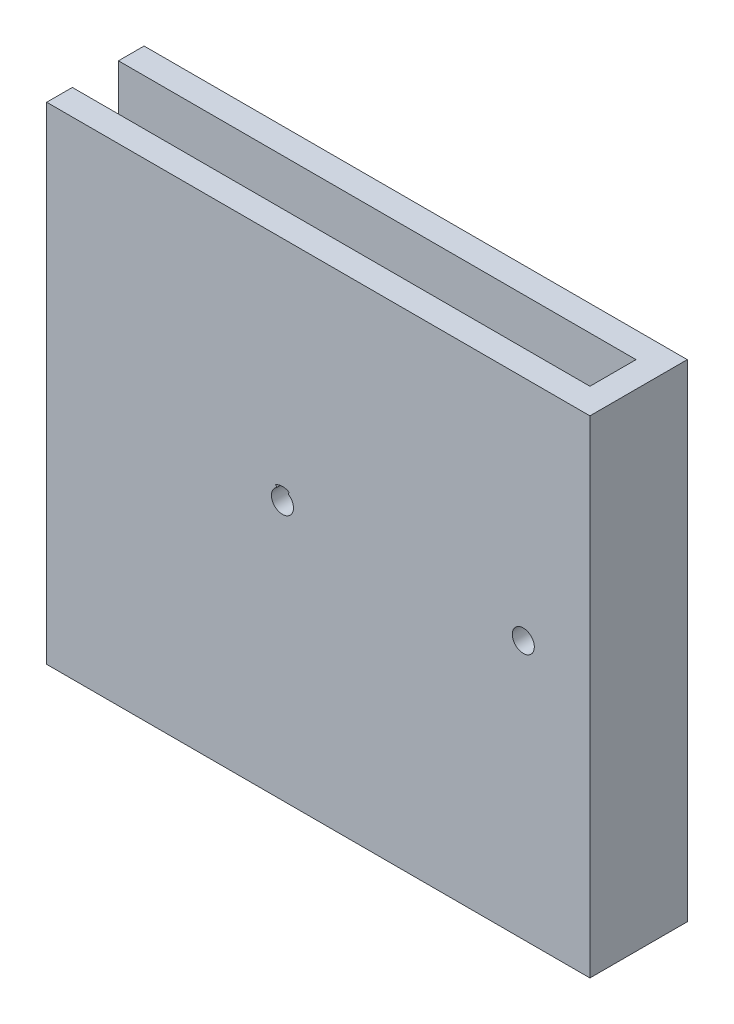
ISO-10303-21;
HEADER;
FILE_DESCRIPTION(('STEP AP214'),'2;1');
FILE_NAME('part.step','',(''),(''),'','','');
FILE_SCHEMA(('AUTOMOTIVE_DESIGN { 1 0 10303 214 1 1 1 1 }'));
ENDSEC;
DATA;
#1=APPLICATION_CONTEXT('core data for automotive mechanical design processes');
#2=APPLICATION_PROTOCOL_DEFINITION('international standard','automotive_design',2000,#1);
#3=PRODUCT_CONTEXT('',#1,'mechanical');
#4=PRODUCT('Part','Part','',(#3));
#5=PRODUCT_RELATED_PRODUCT_CATEGORY('part','',(#4));
#6=PRODUCT_DEFINITION_FORMATION('','',#4);
#7=PRODUCT_DEFINITION_CONTEXT('part definition',#1,'design');
#8=PRODUCT_DEFINITION('design','',#6,#7);
#9=PRODUCT_DEFINITION_SHAPE('','',#8);
#10=(LENGTH_UNIT() NAMED_UNIT(*) SI_UNIT(.MILLI.,.METRE.));
#11=(NAMED_UNIT(*) PLANE_ANGLE_UNIT() SI_UNIT($,.RADIAN.));
#12=(NAMED_UNIT(*) SI_UNIT($,.STERADIAN.) SOLID_ANGLE_UNIT());
#13=UNCERTAINTY_MEASURE_WITH_UNIT(LENGTH_MEASURE(1.E-05),#10,'distance_accuracy_value','');
#14=(GEOMETRIC_REPRESENTATION_CONTEXT(3) GLOBAL_UNCERTAINTY_ASSIGNED_CONTEXT((#13)) GLOBAL_UNIT_ASSIGNED_CONTEXT((#10,
#11,#12)) REPRESENTATION_CONTEXT('',''));
#15=CARTESIAN_POINT('',(0.,0.,0.));
#16=DIRECTION('',(0.,0.,1.));
#17=DIRECTION('',(1.,0.,0.));
#18=AXIS2_PLACEMENT_3D('',#15,#16,#17);
#19=CARTESIAN_POINT('',(-20.1463414634146,55.4268292682927,5.));
#20=DIRECTION('',(1.,0.,0.));
#21=DIRECTION('',(0.,0.,-1.));
#22=AXIS2_PLACEMENT_3D('',#19,#20,#21);
#23=PLANE('',#22);
#24=DIRECTION('',(0.,-1.,0.));
#25=VECTOR('',#24,1.);
#26=CARTESIAN_POINT('',(-20.1463414634146,55.4268292682927,0.));
#27=LINE('',#26,#25);
#28=CARTESIAN_POINT('',(-20.1463414634146,55.4268292682927,0.));
#29=VERTEX_POINT('',#28);
#30=CARTESIAN_POINT('',(-20.1463414634146,-34.5731707317073,0.));
#31=VERTEX_POINT('',#30);
#32=EDGE_CURVE('E301',#29,#31,#27,.T.);
#33=ORIENTED_EDGE('',*,*,#32,.T.);
#34=DIRECTION('',(0.,0.,-1.));
#35=VECTOR('',#34,1.);
#36=CARTESIAN_POINT('',(-20.1463414634146,-34.5731707317073,5.));
#37=LINE('',#36,#35);
#38=CARTESIAN_POINT('',(-20.1463414634146,-34.5731707317073,-9.00000000000001));
#39=VERTEX_POINT('',#38);
#40=EDGE_CURVE('E247',#31,#39,#37,.T.);
#41=ORIENTED_EDGE('',*,*,#40,.T.);
#42=DIRECTION('',(0.,1.,0.));
#43=VECTOR('',#42,1.);
#44=CARTESIAN_POINT('',(-20.1463414634146,55.4268292682927,-9.00000000000001));
#45=LINE('',#44,#43);
#46=CARTESIAN_POINT('',(-20.1463414634146,55.4268292682927,-9.00000000000001));
#47=VERTEX_POINT('',#46);
#48=EDGE_CURVE('E283',#39,#47,#45,.T.);
#49=ORIENTED_EDGE('',*,*,#48,.T.);
#50=DIRECTION('',(0.,0.,1.));
#51=VECTOR('',#50,1.);
#52=CARTESIAN_POINT('',(-20.1463414634146,55.4268292682927,-14.));
#53=LINE('',#52,#51);
#54=CARTESIAN_POINT('',(-20.1463414634146,55.4268292682927,-14.));
#55=VERTEX_POINT('',#54);
#56=EDGE_CURVE('E279',#55,#47,#53,.T.);
#57=ORIENTED_EDGE('',*,*,#56,.F.);
#58=DIRECTION('',(0.,1.,0.));
#59=VECTOR('',#58,1.);
#60=CARTESIAN_POINT('',(-20.1463414634146,55.4268292682927,-14.));
#61=LINE('',#60,#59);
#62=CARTESIAN_POINT('',(-20.1463414634146,-39.5731707317073,-14.));
#63=VERTEX_POINT('',#62);
#64=EDGE_CURVE('E271',#63,#55,#61,.T.);
#65=ORIENTED_EDGE('',*,*,#64,.F.);
#66=DIRECTION('',(0.,0.,-1.));
#67=VECTOR('',#66,1.);
#68=CARTESIAN_POINT('',(-20.1463414634146,-39.5731707317073,5.));
#69=LINE('',#68,#67);
#70=CARTESIAN_POINT('',(-20.1463414634146,-39.5731707317073,5.));
#71=VERTEX_POINT('',#70);
#72=EDGE_CURVE('E248',#71,#63,#69,.T.);
#73=ORIENTED_EDGE('',*,*,#72,.F.);
#74=DIRECTION('',(0.,-1.,0.));
#75=VECTOR('',#74,1.);
#76=CARTESIAN_POINT('',(-20.1463414634146,55.4268292682927,5.));
#77=LINE('',#76,#75);
#78=CARTESIAN_POINT('',(-20.1463414634146,55.4268292682927,5.));
#79=VERTEX_POINT('',#78);
#80=EDGE_CURVE('E312',#79,#71,#77,.T.);
#81=ORIENTED_EDGE('',*,*,#80,.F.);
#82=DIRECTION('',(0.,0.,-1.));
#83=VECTOR('',#82,1.);
#84=CARTESIAN_POINT('',(-20.1463414634146,55.4268292682927,5.));
#85=LINE('',#84,#83);
#86=EDGE_CURVE('E319',#79,#29,#85,.T.);
#87=ORIENTED_EDGE('',*,*,#86,.T.);
#88=EDGE_LOOP('',(#33,#41,#49,#57,#65,#73,#81,#87));
#89=FACE_BOUND('',#88,.T.);
#90=ADVANCED_FACE('F41',(#89),#23,.F.);
#91=CARTESIAN_POINT('',(-20.1463414634146,55.4268292682927,5.));
#92=DIRECTION('',(0.,1.,0.));
#93=DIRECTION('',(-1.,0.,0.));
#94=AXIS2_PLACEMENT_3D('',#91,#92,#93);
#95=PLANE('',#94);
#96=DIRECTION('',(1.,0.,0.));
#97=VECTOR('',#96,1.);
#98=CARTESIAN_POINT('',(-20.1463414634146,55.4268292682927,0.));
#99=LINE('',#98,#97);
#100=CARTESIAN_POINT('',(80.8536585365854,55.4268292682927,0.));
#101=VERTEX_POINT('',#100);
#102=EDGE_CURVE('E316',#29,#101,#99,.T.);
#103=ORIENTED_EDGE('',*,*,#102,.F.);
#104=ORIENTED_EDGE('',*,*,#86,.F.);
#105=DIRECTION('',(1.,0.,0.));
#106=VECTOR('',#105,1.);
#107=CARTESIAN_POINT('',(-20.1463414634146,55.4268292682927,5.));
#108=LINE('',#107,#106);
#109=CARTESIAN_POINT('',(85.8536585365854,55.4268292682927,5.));
#110=VERTEX_POINT('',#109);
#111=EDGE_CURVE('E315',#79,#110,#108,.T.);
#112=ORIENTED_EDGE('',*,*,#111,.T.);
#113=DIRECTION('',(0.,0.,1.));
#114=VECTOR('',#113,1.);
#115=CARTESIAN_POINT('',(85.8536585365854,55.4268292682927,5.));
#116=LINE('',#115,#114);
#117=CARTESIAN_POINT('',(85.8536585365854,55.4268292682927,-14.));
#118=VERTEX_POINT('',#117);
#119=EDGE_CURVE('E296',#118,#110,#116,.T.);
#120=ORIENTED_EDGE('',*,*,#119,.F.);
#121=DIRECTION('',(1.,0.,0.));
#122=VECTOR('',#121,1.);
#123=CARTESIAN_POINT('',(85.8536585365854,55.4268292682927,-14.));
#124=LINE('',#123,#122);
#125=EDGE_CURVE('E275',#55,#118,#124,.T.);
#126=ORIENTED_EDGE('',*,*,#125,.F.);
#127=ORIENTED_EDGE('',*,*,#56,.T.);
#128=DIRECTION('',(1.,0.,0.));
#129=VECTOR('',#128,1.);
#130=CARTESIAN_POINT('',(85.8536585365854,55.4268292682927,-9.00000000000001));
#131=LINE('',#130,#129);
#132=CARTESIAN_POINT('',(80.8536585365854,55.4268292682927,-9.00000000000001));
#133=VERTEX_POINT('',#132);
#134=EDGE_CURVE('E272',#47,#133,#131,.T.);
#135=ORIENTED_EDGE('',*,*,#134,.T.);
#136=DIRECTION('',(0.,0.,1.));
#137=VECTOR('',#136,1.);
#138=CARTESIAN_POINT('',(80.8536585365854,55.4268292682927,5.));
#139=LINE('',#138,#137);
#140=EDGE_CURVE('E297',#133,#101,#139,.T.);
#141=ORIENTED_EDGE('',*,*,#140,.T.);
#142=EDGE_LOOP('',(#103,#104,#112,#120,#126,#127,#135,#141));
#143=FACE_BOUND('',#142,.T.);
#144=ADVANCED_FACE('F363',(#143),#95,.T.);
#145=CARTESIAN_POINT('',(0.,0.,5.));
#146=DIRECTION('',(0.,0.,1.));
#147=DIRECTION('',(1.,0.,0.));
#148=AXIS2_PLACEMENT_3D('',#145,#146,#147);
#149=PLANE('',#148);
#150=DIRECTION('',(0.515038074910054,-0.857167300702112,0.));
#151=VECTOR('',#150,1.);
#152=CARTESIAN_POINT('',(25.8536585365854,10.9268292682927,5.));
#153=LINE('',#152,#151);
#154=CARTESIAN_POINT('',(24.5248603033175,13.1383209041041,5.));
#155=VERTEX_POINT('',#154);
#156=CARTESIAN_POINT('',(24.7463266755288,12.7697389648022,5.));
#157=VERTEX_POINT('',#156);
#158=EDGE_CURVE('E173',#155,#157,#153,.T.);
#159=ORIENTED_EDGE('',*,*,#158,.F.);
#160=CARTESIAN_POINT('',(25.8536585365854,10.9268292682927,5.));
#161=DIRECTION('',(0.,0.,1.));
#162=DIRECTION('',(1.,0.,0.));
#163=AXIS2_PLACEMENT_3D('',#160,#161,#162);
#164=CIRCLE('',#163,2.58);
#165=CARTESIAN_POINT('',(27.1824567698533,13.1383209041041,5.));
#166=VERTEX_POINT('',#165);
#167=EDGE_CURVE('E160',#166,#155,#164,.T.);
#168=ORIENTED_EDGE('',*,*,#167,.F.);
#169=DIRECTION('',(0.515038074910054,0.857167300702112,0.));
#170=VECTOR('',#169,1.);
#171=CARTESIAN_POINT('',(25.8536585365854,10.9268292682927,5.));
#172=LINE('',#171,#170);
#173=CARTESIAN_POINT('',(26.960990397642,12.7697389648022,5.));
#174=VERTEX_POINT('',#173);
#175=EDGE_CURVE('E166',#174,#166,#172,.T.);
#176=ORIENTED_EDGE('',*,*,#175,.F.);
#177=CARTESIAN_POINT('',(25.8536585365854,10.9268292682927,5.));
#178=DIRECTION('',(0.,0.,-1.));
#179=DIRECTION('',(0.,1.,0.));
#180=AXIS2_PLACEMENT_3D('',#177,#178,#179);
#181=CIRCLE('',#180,2.15);
#182=EDGE_CURVE('E226',#174,#157,#181,.T.);
#183=ORIENTED_EDGE('',*,*,#182,.T.);
#184=EDGE_LOOP('',(#159,#168,#176,#183));
#185=FACE_BOUND('',#184,.T.);
#186=CARTESIAN_POINT('',(72.8536585365854,10.9268292682927,5.));
#187=DIRECTION('',(0.,0.,-1.));
#188=DIRECTION('',(0.,1.,0.));
#189=AXIS2_PLACEMENT_3D('',#186,#187,#188);
#190=CIRCLE('',#189,2.15);
#191=CARTESIAN_POINT('',(72.8536585365854,13.0768292682927,5.));
#192=VERTEX_POINT('',#191);
#193=EDGE_CURVE('E217',#192,#192,#190,.T.);
#194=ORIENTED_EDGE('',*,*,#193,.T.);
#195=EDGE_LOOP('',(#194));
#196=FACE_BOUND('',#195,.T.);
#197=ORIENTED_EDGE('',*,*,#80,.T.);
#198=DIRECTION('',(-1.,0.,0.));
#199=VECTOR('',#198,1.);
#200=CARTESIAN_POINT('',(-20.1463414634146,-39.5731707317073,5.));
#201=LINE('',#200,#199);
#202=CARTESIAN_POINT('',(85.8536585365854,-39.5731707317073,5.));
#203=VERTEX_POINT('',#202);
#204=EDGE_CURVE('E260',#203,#71,#201,.T.);
#205=ORIENTED_EDGE('',*,*,#204,.F.);
#206=DIRECTION('',(0.,-1.,0.));
#207=VECTOR('',#206,1.);
#208=CARTESIAN_POINT('',(85.8536585365854,55.4268292682927,5.));
#209=LINE('',#208,#207);
#210=EDGE_CURVE('E293',#110,#203,#209,.T.);
#211=ORIENTED_EDGE('',*,*,#210,.F.);
#212=ORIENTED_EDGE('',*,*,#111,.F.);
#213=EDGE_LOOP('',(#197,#205,#211,#212));
#214=FACE_BOUND('',#213,.T.);
#215=ADVANCED_FACE('F175',(#185,#196,#214),#149,.T.);
#216=CARTESIAN_POINT('',(0.,0.,0.));
#217=DIRECTION('',(0.,0.,1.));
#218=DIRECTION('',(1.,0.,0.));
#219=AXIS2_PLACEMENT_3D('',#216,#217,#218);
#220=PLANE('',#219);
#221=CARTESIAN_POINT('',(72.8536585365854,10.9268292682927,0.));
#222=DIRECTION('',(0.,0.,1.));
#223=DIRECTION('',(1.,0.,0.));
#224=AXIS2_PLACEMENT_3D('',#221,#222,#223);
#225=CIRCLE('',#224,2.15);
#226=CARTESIAN_POINT('',(75.0036585365854,10.9268292682927,0.));
#227=VERTEX_POINT('',#226);
#228=EDGE_CURVE('E243',#227,#227,#225,.T.);
#229=ORIENTED_EDGE('',*,*,#228,.T.);
#230=EDGE_LOOP('',(#229));
#231=FACE_BOUND('',#230,.T.);
#232=CARTESIAN_POINT('',(25.8536585365854,10.9268292682927,0.));
#233=DIRECTION('',(0.,0.,1.));
#234=DIRECTION('',(1.,0.,0.));
#235=AXIS2_PLACEMENT_3D('',#232,#233,#234);
#236=CIRCLE('',#235,2.58);
#237=CARTESIAN_POINT('',(27.1824567698533,13.1383209041041,0.));
#238=VERTEX_POINT('',#237);
#239=CARTESIAN_POINT('',(24.5248603033175,13.1383209041041,0.));
#240=VERTEX_POINT('',#239);
#241=EDGE_CURVE('E11',#238,#240,#236,.T.);
#242=ORIENTED_EDGE('',*,*,#241,.T.);
#243=DIRECTION('',(0.515038074910054,-0.857167300702112,0.));
#244=VECTOR('',#243,1.);
#245=CARTESIAN_POINT('',(23.8195168067542,14.3122096134437,0.));
#246=LINE('',#245,#244);
#247=CARTESIAN_POINT('',(24.7463266755288,12.7697389648022,0.));
#248=VERTEX_POINT('',#247);
#249=EDGE_CURVE('E185',#240,#248,#246,.T.);
#250=ORIENTED_EDGE('',*,*,#249,.T.);
#251=CARTESIAN_POINT('',(25.8536585365854,10.9268292682927,0.));
#252=DIRECTION('',(0.,0.,1.));
#253=DIRECTION('',(1.,0.,0.));
#254=AXIS2_PLACEMENT_3D('',#251,#252,#253);
#255=CIRCLE('',#254,2.15);
#256=CARTESIAN_POINT('',(26.960990397642,12.7697389648022,0.));
#257=VERTEX_POINT('',#256);
#258=EDGE_CURVE('E235',#248,#257,#255,.T.);
#259=ORIENTED_EDGE('',*,*,#258,.T.);
#260=DIRECTION('',(0.515038074910054,0.857167300702112,0.));
#261=VECTOR('',#260,1.);
#262=CARTESIAN_POINT('',(14.1716992067347,-8.51521595803101,0.));
#263=LINE('',#262,#261);
#264=EDGE_CURVE('E56',#257,#238,#263,.T.);
#265=ORIENTED_EDGE('',*,*,#264,.T.);
#266=EDGE_LOOP('',(#242,#250,#259,#265));
#267=FACE_BOUND('',#266,.T.);
#268=ORIENTED_EDGE('',*,*,#32,.F.);
#269=ORIENTED_EDGE('',*,*,#102,.T.);
#270=DIRECTION('',(0.,-1.,0.));
#271=VECTOR('',#270,1.);
#272=CARTESIAN_POINT('',(80.8536585365854,55.4268292682927,0.));
#273=LINE('',#272,#271);
#274=CARTESIAN_POINT('',(80.8536585365854,-34.5731707317073,0.));
#275=VERTEX_POINT('',#274);
#276=EDGE_CURVE('E327',#101,#275,#273,.T.);
#277=ORIENTED_EDGE('',*,*,#276,.T.);
#278=DIRECTION('',(1.,0.,0.));
#279=VECTOR('',#278,1.);
#280=CARTESIAN_POINT('',(-20.1463414634146,-34.5731707317073,0.));
#281=LINE('',#280,#279);
#282=EDGE_CURVE('E323',#31,#275,#281,.T.);
#283=ORIENTED_EDGE('',*,*,#282,.F.);
#284=EDGE_LOOP('',(#268,#269,#277,#283));
#285=FACE_BOUND('',#284,.T.);
#286=ADVANCED_FACE('F352',(#231,#267,#285),#220,.F.);
#287=CARTESIAN_POINT('',(85.8536585365854,0.,0.));
#288=DIRECTION('',(1.,0.,0.));
#289=DIRECTION('',(0.,0.,-1.));
#290=AXIS2_PLACEMENT_3D('',#287,#288,#289);
#291=PLANE('',#290);
#292=ORIENTED_EDGE('',*,*,#210,.T.);
#293=DIRECTION('',(0.,0.,1.));
#294=VECTOR('',#293,1.);
#295=CARTESIAN_POINT('',(85.8536585365854,-39.5731707317073,5.));
#296=LINE('',#295,#294);
#297=CARTESIAN_POINT('',(85.8536585365854,-39.5731707317073,-14.));
#298=VERTEX_POINT('',#297);
#299=EDGE_CURVE('E256',#298,#203,#296,.T.);
#300=ORIENTED_EDGE('',*,*,#299,.F.);
#301=DIRECTION('',(0.,-1.,0.));
#302=VECTOR('',#301,1.);
#303=CARTESIAN_POINT('',(85.8536585365854,55.4268292682927,-14.));
#304=LINE('',#303,#302);
#305=EDGE_CURVE('E268',#118,#298,#304,.T.);
#306=ORIENTED_EDGE('',*,*,#305,.F.);
#307=ORIENTED_EDGE('',*,*,#119,.T.);
#308=EDGE_LOOP('',(#292,#300,#306,#307));
#309=FACE_BOUND('',#308,.T.);
#310=ADVANCED_FACE('F355',(#309),#291,.T.);
#311=CARTESIAN_POINT('',(80.8536585365854,0.,0.));
#312=DIRECTION('',(1.,0.,0.));
#313=DIRECTION('',(0.,0.,-1.));
#314=AXIS2_PLACEMENT_3D('',#311,#312,#313);
#315=PLANE('',#314);
#316=ORIENTED_EDGE('',*,*,#276,.F.);
#317=ORIENTED_EDGE('',*,*,#140,.F.);
#318=DIRECTION('',(0.,1.,0.));
#319=VECTOR('',#318,1.);
#320=CARTESIAN_POINT('',(80.8536585365854,55.4268292682927,-9.00000000000001));
#321=LINE('',#320,#319);
#322=CARTESIAN_POINT('',(80.8536585365854,-34.5731707317073,-9.00000000000001));
#323=VERTEX_POINT('',#322);
#324=EDGE_CURVE('E305',#323,#133,#321,.T.);
#325=ORIENTED_EDGE('',*,*,#324,.F.);
#326=DIRECTION('',(0.,0.,-1.));
#327=VECTOR('',#326,1.);
#328=CARTESIAN_POINT('',(80.8536585365854,-34.5731707317073,5.));
#329=LINE('',#328,#327);
#330=EDGE_CURVE('E292',#275,#323,#329,.T.);
#331=ORIENTED_EDGE('',*,*,#330,.F.);
#332=EDGE_LOOP('',(#316,#317,#325,#331));
#333=FACE_BOUND('',#332,.T.);
#334=ADVANCED_FACE('F367',(#333),#315,.F.);
#335=CARTESIAN_POINT('',(0.,0.,-9.00000000000001));
#336=DIRECTION('',(0.,0.,-1.));
#337=DIRECTION('',(0.,1.,0.));
#338=AXIS2_PLACEMENT_3D('',#335,#336,#337);
#339=PLANE('',#338);
#340=CARTESIAN_POINT('',(72.8536585365854,10.9268292682927,-9.00000000000001));
#341=DIRECTION('',(0.,0.,-1.));
#342=DIRECTION('',(0.,1.,0.));
#343=AXIS2_PLACEMENT_3D('',#340,#341,#342);
#344=CIRCLE('',#343,2.58);
#345=CARTESIAN_POINT('',(71.5248603033175,13.1383209041041,-9.00000000000001));
#346=VERTEX_POINT('',#345);
#347=CARTESIAN_POINT('',(74.1824567698533,13.1383209041041,-9.00000000000001));
#348=VERTEX_POINT('',#347);
#349=EDGE_CURVE('E212',#346,#348,#344,.T.);
#350=ORIENTED_EDGE('',*,*,#349,.T.);
#351=DIRECTION('',(-0.515038074910049,-0.857167300702116,0.));
#352=VECTOR('',#351,1.);
#353=CARTESIAN_POINT('',(48.7042809322036,-29.2644843902156,-9.00000000000001));
#354=LINE('',#353,#352);
#355=CARTESIAN_POINT('',(73.960990397642,12.7697389648022,-9.00000000000001));
#356=VERTEX_POINT('',#355);
#357=EDGE_CURVE('E208',#348,#356,#354,.T.);
#358=ORIENTED_EDGE('',*,*,#357,.T.);
#359=CARTESIAN_POINT('',(72.8536585365854,10.9268292682927,-9.00000000000001));
#360=DIRECTION('',(0.,0.,-1.));
#361=DIRECTION('',(0.,1.,0.));
#362=AXIS2_PLACEMENT_3D('',#359,#360,#361);
#363=CIRCLE('',#362,2.15);
#364=CARTESIAN_POINT('',(71.7463266755288,12.7697389648022,-9.00000000000001));
#365=VERTEX_POINT('',#364);
#366=EDGE_CURVE('E239',#356,#365,#363,.T.);
#367=ORIENTED_EDGE('',*,*,#366,.T.);
#368=DIRECTION('',(-0.515038074910049,0.857167300702116,0.));
#369=VECTOR('',#368,1.);
#370=CARTESIAN_POINT('',(58.352098532223,35.0614780456282,-9.00000000000001));
#371=LINE('',#370,#369);
#372=EDGE_CURVE('E64',#365,#346,#371,.T.);
#373=ORIENTED_EDGE('',*,*,#372,.T.);
#374=EDGE_LOOP('',(#350,#358,#367,#373));
#375=FACE_BOUND('',#374,.T.);
#376=CARTESIAN_POINT('',(25.8536585365854,10.9268292682927,-9.00000000000001));
#377=DIRECTION('',(0.,0.,-1.));
#378=DIRECTION('',(0.,1.,0.));
#379=AXIS2_PLACEMENT_3D('',#376,#377,#378);
#380=CIRCLE('',#379,2.15);
#381=CARTESIAN_POINT('',(25.8536585365854,13.0768292682927,-9.00000000000001));
#382=VERTEX_POINT('',#381);
#383=EDGE_CURVE('E221',#382,#382,#380,.T.);
#384=ORIENTED_EDGE('',*,*,#383,.T.);
#385=EDGE_LOOP('',(#384));
#386=FACE_BOUND('',#385,.T.);
#387=DIRECTION('',(-1.,0.,0.));
#388=VECTOR('',#387,1.);
#389=CARTESIAN_POINT('',(85.8536585365854,-34.5731707317073,-9.00000000000001));
#390=LINE('',#389,#388);
#391=EDGE_CURVE('E264',#323,#39,#390,.T.);
#392=ORIENTED_EDGE('',*,*,#391,.F.);
#393=ORIENTED_EDGE('',*,*,#324,.T.);
#394=ORIENTED_EDGE('',*,*,#134,.F.);
#395=ORIENTED_EDGE('',*,*,#48,.F.);
#396=EDGE_LOOP('',(#392,#393,#394,#395));
#397=FACE_BOUND('',#396,.T.);
#398=ADVANCED_FACE('F370',(#375,#386,#397),#339,.F.);
#399=CARTESIAN_POINT('',(0.,0.,-14.));
#400=DIRECTION('',(0.,0.,-1.));
#401=DIRECTION('',(0.,1.,0.));
#402=AXIS2_PLACEMENT_3D('',#399,#400,#401);
#403=PLANE('',#402);
#404=DIRECTION('',(-0.515038074910049,-0.857167300702116,0.));
#405=VECTOR('',#404,1.);
#406=CARTESIAN_POINT('',(72.8536585365854,10.9268292682927,-14.));
#407=LINE('',#406,#405);
#408=CARTESIAN_POINT('',(74.1824567698533,13.1383209041041,-14.));
#409=VERTEX_POINT('',#408);
#410=CARTESIAN_POINT('',(73.960990397642,12.7697389648022,-14.));
#411=VERTEX_POINT('',#410);
#412=EDGE_CURVE('E189',#409,#411,#407,.T.);
#413=ORIENTED_EDGE('',*,*,#412,.F.);
#414=CARTESIAN_POINT('',(72.8536585365854,10.9268292682927,-14.));
#415=DIRECTION('',(0.,0.,-1.));
#416=DIRECTION('',(0.,1.,0.));
#417=AXIS2_PLACEMENT_3D('',#414,#415,#416);
#418=CIRCLE('',#417,2.58);
#419=CARTESIAN_POINT('',(71.5248603033175,13.1383209041041,-14.));
#420=VERTEX_POINT('',#419);
#421=EDGE_CURVE('E196',#420,#409,#418,.T.);
#422=ORIENTED_EDGE('',*,*,#421,.F.);
#423=DIRECTION('',(-0.515038074910049,0.857167300702116,0.));
#424=VECTOR('',#423,1.);
#425=CARTESIAN_POINT('',(72.8536585365854,10.9268292682927,-14.));
#426=LINE('',#425,#424);
#427=CARTESIAN_POINT('',(71.7463266755288,12.7697389648022,-14.));
#428=VERTEX_POINT('',#427);
#429=EDGE_CURVE('E192',#428,#420,#426,.T.);
#430=ORIENTED_EDGE('',*,*,#429,.F.);
#431=CARTESIAN_POINT('',(72.8536585365854,10.9268292682927,-14.));
#432=DIRECTION('',(0.,0.,-1.));
#433=DIRECTION('',(0.,1.,0.));
#434=AXIS2_PLACEMENT_3D('',#431,#432,#433);
#435=CIRCLE('',#434,2.15);
#436=EDGE_CURVE('E222',#411,#428,#435,.T.);
#437=ORIENTED_EDGE('',*,*,#436,.F.);
#438=EDGE_LOOP('',(#413,#422,#430,#437));
#439=FACE_BOUND('',#438,.T.);
#440=CARTESIAN_POINT('',(25.8536585365854,10.9268292682927,-14.));
#441=DIRECTION('',(0.,0.,-1.));
#442=DIRECTION('',(0.,1.,0.));
#443=AXIS2_PLACEMENT_3D('',#440,#441,#442);
#444=CIRCLE('',#443,2.15);
#445=CARTESIAN_POINT('',(25.8536585365854,13.0768292682927,-14.));
#446=VERTEX_POINT('',#445);
#447=EDGE_CURVE('E216',#446,#446,#444,.T.);
#448=ORIENTED_EDGE('',*,*,#447,.F.);
#449=EDGE_LOOP('',(#448));
#450=FACE_BOUND('',#449,.T.);
#451=ORIENTED_EDGE('',*,*,#305,.T.);
#452=DIRECTION('',(1.,0.,0.));
#453=VECTOR('',#452,1.);
#454=CARTESIAN_POINT('',(-20.1463414634146,-39.5731707317073,-14.));
#455=LINE('',#454,#453);
#456=EDGE_CURVE('E252',#63,#298,#455,.T.);
#457=ORIENTED_EDGE('',*,*,#456,.F.);
#458=ORIENTED_EDGE('',*,*,#64,.T.);
#459=ORIENTED_EDGE('',*,*,#125,.T.);
#460=EDGE_LOOP('',(#451,#457,#458,#459));
#461=FACE_BOUND('',#460,.T.);
#462=ADVANCED_FACE('F377',(#439,#450,#461),#403,.T.);
#463=CARTESIAN_POINT('',(0.,-34.5731707317073,0.));
#464=DIRECTION('',(0.,-1.,0.));
#465=DIRECTION('',(0.,0.,-1.));
#466=AXIS2_PLACEMENT_3D('',#463,#464,#465);
#467=PLANE('',#466);
#468=ORIENTED_EDGE('',*,*,#40,.F.);
#469=ORIENTED_EDGE('',*,*,#282,.T.);
#470=ORIENTED_EDGE('',*,*,#330,.T.);
#471=ORIENTED_EDGE('',*,*,#391,.T.);
#472=EDGE_LOOP('',(#468,#469,#470,#471));
#473=FACE_BOUND('',#472,.T.);
#474=ADVANCED_FACE('F372',(#473),#467,.F.);
#475=CARTESIAN_POINT('',(0.,-39.5731707317073,0.));
#476=DIRECTION('',(0.,-1.,0.));
#477=DIRECTION('',(0.,0.,-1.));
#478=AXIS2_PLACEMENT_3D('',#475,#476,#477);
#479=PLANE('',#478);
#480=ORIENTED_EDGE('',*,*,#72,.T.);
#481=ORIENTED_EDGE('',*,*,#456,.T.);
#482=ORIENTED_EDGE('',*,*,#299,.T.);
#483=ORIENTED_EDGE('',*,*,#204,.T.);
#484=EDGE_LOOP('',(#480,#481,#482,#483));
#485=FACE_BOUND('',#484,.T.);
#486=ADVANCED_FACE('F384',(#485),#479,.T.);
#487=CARTESIAN_POINT('',(25.8536585365854,10.9268292682927,5.));
#488=DIRECTION('',(0.,0.,-1.));
#489=DIRECTION('',(0.,1.,0.));
#490=AXIS2_PLACEMENT_3D('',#487,#488,#489);
#491=CYLINDRICAL_SURFACE('',#490,2.15);
#492=ORIENTED_EDGE('',*,*,#447,.T.);
#493=EDGE_LOOP('',(#492));
#494=FACE_BOUND('',#493,.T.);
#495=ORIENTED_EDGE('',*,*,#383,.F.);
#496=EDGE_LOOP('',(#495));
#497=FACE_BOUND('',#496,.T.);
#498=ADVANCED_FACE('F450',(#494,#497),#491,.F.);
#499=CARTESIAN_POINT('',(72.8536585365854,10.9268292682927,5.));
#500=DIRECTION('',(0.,0.,-1.));
#501=DIRECTION('',(0.,1.,0.));
#502=AXIS2_PLACEMENT_3D('',#499,#500,#501);
#503=CYLINDRICAL_SURFACE('',#502,2.15);
#504=ORIENTED_EDGE('',*,*,#366,.F.);
#505=DIRECTION('',(0.,0.,-1.));
#506=VECTOR('',#505,1.);
#507=CARTESIAN_POINT('',(73.960990397642,12.7697389648022,5.));
#508=LINE('',#507,#506);
#509=EDGE_CURVE('E339',#356,#411,#508,.T.);
#510=ORIENTED_EDGE('',*,*,#509,.T.);
#511=ORIENTED_EDGE('',*,*,#436,.T.);
#512=DIRECTION('',(0.,0.,-1.));
#513=VECTOR('',#512,1.);
#514=CARTESIAN_POINT('',(71.7463266755288,12.7697389648022,5.));
#515=LINE('',#514,#513);
#516=EDGE_CURVE('E336',#428,#365,#515,.F.);
#517=ORIENTED_EDGE('',*,*,#516,.T.);
#518=EDGE_LOOP('',(#504,#510,#511,#517));
#519=FACE_BOUND('',#518,.T.);
#520=ADVANCED_FACE('F460',(#519),#503,.F.);
#521=ORIENTED_EDGE('',*,*,#258,.F.);
#522=DIRECTION('',(0.,0.,-1.));
#523=VECTOR('',#522,1.);
#524=CARTESIAN_POINT('',(24.7463266755288,12.7697389648022,5.));
#525=LINE('',#524,#523);
#526=EDGE_CURVE('E49',#248,#157,#525,.F.);
#527=ORIENTED_EDGE('',*,*,#526,.T.);
#528=ORIENTED_EDGE('',*,*,#182,.F.);
#529=DIRECTION('',(0.,0.,-1.));
#530=VECTOR('',#529,1.);
#531=CARTESIAN_POINT('',(26.960990397642,12.7697389648022,5.));
#532=LINE('',#531,#530);
#533=EDGE_CURVE('E168',#174,#257,#532,.T.);
#534=ORIENTED_EDGE('',*,*,#533,.T.);
#535=EDGE_LOOP('',(#521,#527,#528,#534));
#536=FACE_BOUND('',#535,.T.);
#537=ADVANCED_FACE('F348',(#536),#491,.F.);
#538=ORIENTED_EDGE('',*,*,#193,.F.);
#539=EDGE_LOOP('',(#538));
#540=FACE_BOUND('',#539,.T.);
#541=ORIENTED_EDGE('',*,*,#228,.F.);
#542=EDGE_LOOP('',(#541));
#543=FACE_BOUND('',#542,.T.);
#544=ADVANCED_FACE('F469',(#540,#543),#503,.F.);
#545=CARTESIAN_POINT('',(72.8536585365854,10.9268292682927,-4.00000000000001));
#546=DIRECTION('',(0.,0.,-1.));
#547=DIRECTION('',(0.,1.,0.));
#548=AXIS2_PLACEMENT_3D('',#545,#546,#547);
#549=CYLINDRICAL_SURFACE('',#548,2.58);
#550=DIRECTION('',(0.,0.,-1.));
#551=VECTOR('',#550,1.);
#552=CARTESIAN_POINT('',(71.5248603033175,13.1383209041041,-4.00000000000001));
#553=LINE('',#552,#551);
#554=EDGE_CURVE('E200',#346,#420,#553,.T.);
#555=ORIENTED_EDGE('',*,*,#554,.T.);
#556=ORIENTED_EDGE('',*,*,#421,.T.);
#557=DIRECTION('',(0.,0.,-1.));
#558=VECTOR('',#557,1.);
#559=CARTESIAN_POINT('',(74.1824567698533,13.1383209041041,-4.00000000000001));
#560=LINE('',#559,#558);
#561=EDGE_CURVE('E201',#348,#409,#560,.T.);
#562=ORIENTED_EDGE('',*,*,#561,.F.);
#563=ORIENTED_EDGE('',*,*,#349,.F.);
#564=EDGE_LOOP('',(#555,#556,#562,#563));
#565=FACE_BOUND('',#564,.T.);
#566=ADVANCED_FACE('F474',(#565),#549,.F.);
#567=CARTESIAN_POINT('',(72.8536585365854,10.9268292682927,-4.00000000000001));
#568=DIRECTION('',(0.857167300702116,-0.515038074910049,0.));
#569=DIRECTION('',(0.515038074910049,0.857167300702116,0.));
#570=AXIS2_PLACEMENT_3D('',#567,#568,#569);
#571=PLANE('',#570);
#572=ORIENTED_EDGE('',*,*,#561,.T.);
#573=ORIENTED_EDGE('',*,*,#412,.T.);
#574=ORIENTED_EDGE('',*,*,#509,.F.);
#575=ORIENTED_EDGE('',*,*,#357,.F.);
#576=EDGE_LOOP('',(#572,#573,#574,#575));
#577=FACE_BOUND('',#576,.T.);
#578=ADVANCED_FACE('F509',(#577),#571,.F.);
#579=CARTESIAN_POINT('',(72.8536585365854,10.9268292682927,-4.00000000000001));
#580=DIRECTION('',(-0.857167300702116,-0.515038074910049,0.));
#581=DIRECTION('',(0.515038074910049,-0.857167300702116,0.));
#582=AXIS2_PLACEMENT_3D('',#579,#580,#581);
#583=PLANE('',#582);
#584=ORIENTED_EDGE('',*,*,#516,.F.);
#585=ORIENTED_EDGE('',*,*,#429,.T.);
#586=ORIENTED_EDGE('',*,*,#554,.F.);
#587=ORIENTED_EDGE('',*,*,#372,.F.);
#588=EDGE_LOOP('',(#584,#585,#586,#587));
#589=FACE_BOUND('',#588,.T.);
#590=ADVANCED_FACE('F519',(#589),#583,.F.);
#591=CARTESIAN_POINT('',(25.8536585365854,10.9268292682927,-5.));
#592=DIRECTION('',(0.,0.,1.));
#593=DIRECTION('',(1.,0.,0.));
#594=AXIS2_PLACEMENT_3D('',#591,#592,#593);
#595=CYLINDRICAL_SURFACE('',#594,2.58);
#596=DIRECTION('',(0.,0.,1.));
#597=VECTOR('',#596,1.);
#598=CARTESIAN_POINT('',(27.1824567698533,13.1383209041041,-5.));
#599=LINE('',#598,#597);
#600=EDGE_CURVE('E155',#238,#166,#599,.T.);
#601=ORIENTED_EDGE('',*,*,#600,.T.);
#602=ORIENTED_EDGE('',*,*,#167,.T.);
#603=DIRECTION('',(0.,0.,1.));
#604=VECTOR('',#603,1.);
#605=CARTESIAN_POINT('',(24.5248603033175,13.1383209041041,-5.));
#606=LINE('',#605,#604);
#607=EDGE_CURVE('E163',#240,#155,#606,.T.);
#608=ORIENTED_EDGE('',*,*,#607,.F.);
#609=ORIENTED_EDGE('',*,*,#241,.F.);
#610=EDGE_LOOP('',(#601,#602,#608,#609));
#611=FACE_BOUND('',#610,.T.);
#612=ADVANCED_FACE('F157',(#611),#595,.F.);
#613=CARTESIAN_POINT('',(25.8536585365854,10.9268292682927,-5.));
#614=DIRECTION('',(-0.857167300702112,-0.515038074910054,0.));
#615=DIRECTION('',(0.515038074910054,-0.857167300702112,0.));
#616=AXIS2_PLACEMENT_3D('',#613,#614,#615);
#617=PLANE('',#616);
#618=ORIENTED_EDGE('',*,*,#607,.T.);
#619=ORIENTED_EDGE('',*,*,#158,.T.);
#620=ORIENTED_EDGE('',*,*,#526,.F.);
#621=ORIENTED_EDGE('',*,*,#249,.F.);
#622=EDGE_LOOP('',(#618,#619,#620,#621));
#623=FACE_BOUND('',#622,.T.);
#624=ADVANCED_FACE('F350',(#623),#617,.F.);
#625=CARTESIAN_POINT('',(25.8536585365854,10.9268292682927,-5.));
#626=DIRECTION('',(0.857167300702112,-0.515038074910054,0.));
#627=DIRECTION('',(0.515038074910054,0.857167300702112,0.));
#628=AXIS2_PLACEMENT_3D('',#625,#626,#627);
#629=PLANE('',#628);
#630=ORIENTED_EDGE('',*,*,#533,.F.);
#631=ORIENTED_EDGE('',*,*,#175,.T.);
#632=ORIENTED_EDGE('',*,*,#600,.F.);
#633=ORIENTED_EDGE('',*,*,#264,.F.);
#634=EDGE_LOOP('',(#630,#631,#632,#633));
#635=FACE_BOUND('',#634,.T.);
#636=ADVANCED_FACE('F167',(#635),#629,.F.);
#637=CLOSED_SHELL('',(#90,#144,#215,#286,#310,#334,#398,#462,#474,#486,#498,#520,#537,#544,#566,
#578,#590,#612,#624,#636));
#638=MANIFOLD_SOLID_BREP('B2',#637);
#639=ADVANCED_BREP_SHAPE_REPRESENTATION('',(#18,#638),#14);
#640=SHAPE_DEFINITION_REPRESENTATION(#9,#639);
ENDSEC;
END-ISO-10303-21;
